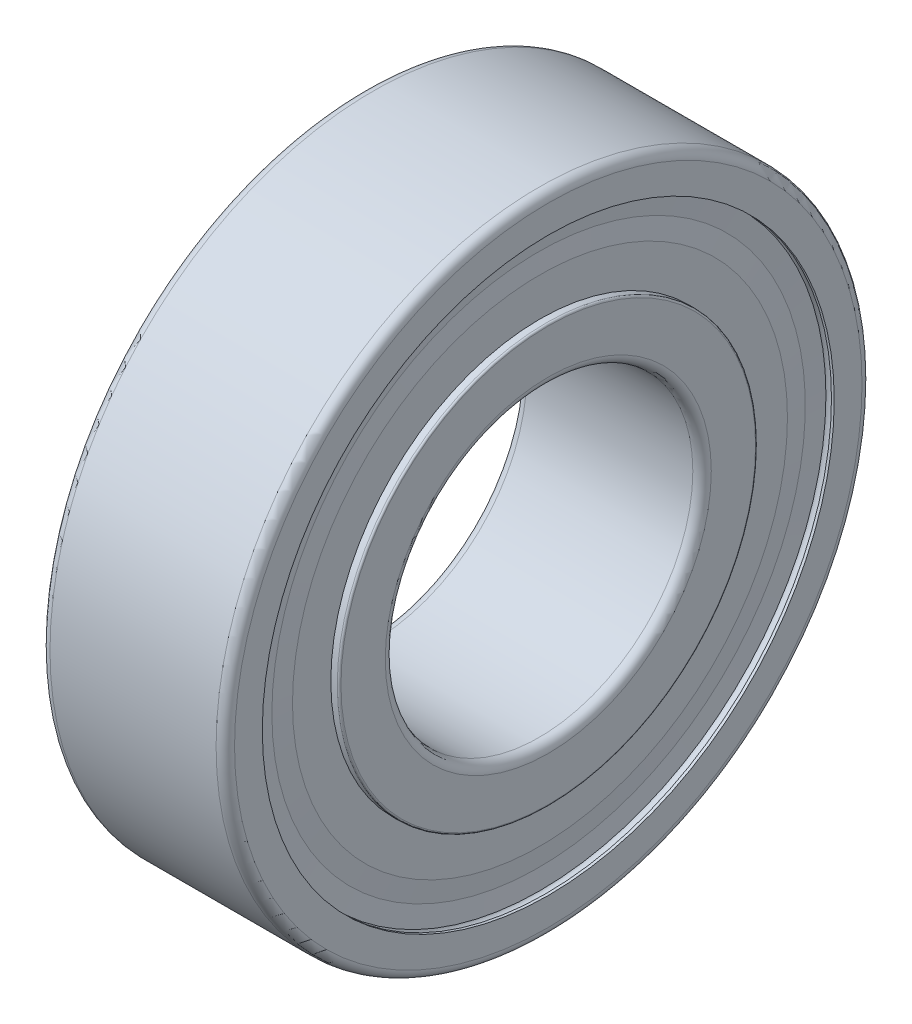
ISO-10303-21;
HEADER;
FILE_DESCRIPTION(('STEP AP214'),'2;1');
FILE_NAME('part.step','',(''),(''),'','','');
FILE_SCHEMA(('AUTOMOTIVE_DESIGN { 1 0 10303 214 1 1 1 1 }'));
ENDSEC;
DATA;
#1=APPLICATION_CONTEXT('core data for automotive mechanical design processes');
#2=APPLICATION_PROTOCOL_DEFINITION('international standard','automotive_design',2000,#1);
#3=PRODUCT_CONTEXT('',#1,'mechanical');
#4=PRODUCT('Part','Part','',(#3));
#5=PRODUCT_RELATED_PRODUCT_CATEGORY('part','',(#4));
#6=PRODUCT_DEFINITION_FORMATION('','',#4);
#7=PRODUCT_DEFINITION_CONTEXT('part definition',#1,'design');
#8=PRODUCT_DEFINITION('design','',#6,#7);
#9=PRODUCT_DEFINITION_SHAPE('','',#8);
#10=(LENGTH_UNIT() NAMED_UNIT(*) SI_UNIT(.MILLI.,.METRE.));
#11=(NAMED_UNIT(*) PLANE_ANGLE_UNIT() SI_UNIT($,.RADIAN.));
#12=(NAMED_UNIT(*) SI_UNIT($,.STERADIAN.) SOLID_ANGLE_UNIT());
#13=UNCERTAINTY_MEASURE_WITH_UNIT(LENGTH_MEASURE(1.E-05),#10,'distance_accuracy_value','');
#14=(GEOMETRIC_REPRESENTATION_CONTEXT(3) GLOBAL_UNCERTAINTY_ASSIGNED_CONTEXT((#13)) GLOBAL_UNIT_ASSIGNED_CONTEXT((#10,
#11,#12)) REPRESENTATION_CONTEXT('',''));
#15=CARTESIAN_POINT('',(0.,0.,0.));
#16=DIRECTION('',(0.,0.,1.));
#17=DIRECTION('',(1.,0.,0.));
#18=AXIS2_PLACEMENT_3D('',#15,#16,#17);
#19=CARTESIAN_POINT('',(50.,0.,0.));
#20=DIRECTION('',(1.,0.,0.));
#21=DIRECTION('',(0.,0.,1.));
#22=AXIS2_PLACEMENT_3D('',#19,#20,#21);
#23=CYLINDRICAL_SURFACE('',#22,18.595);
#24=CARTESIAN_POINT('',(11.46,0.,0.));
#25=DIRECTION('',(-1.,0.,0.));
#26=DIRECTION('',(0.,0.,1.));
#27=AXIS2_PLACEMENT_3D('',#24,#25,#26);
#28=CIRCLE('',#27,18.595);
#29=CARTESIAN_POINT('',(11.46,0.,18.595));
#30=VERTEX_POINT('',#29);
#31=EDGE_CURVE('E12',#30,#30,#28,.T.);
#32=ORIENTED_EDGE('',*,*,#31,.T.);
#33=EDGE_LOOP('',(#32));
#34=FACE_BOUND('',#33,.T.);
#35=CARTESIAN_POINT('',(11.28,0.,0.));
#36=DIRECTION('',(-1.,0.,0.));
#37=DIRECTION('',(0.,0.,1.));
#38=AXIS2_PLACEMENT_3D('',#35,#36,#37);
#39=CIRCLE('',#38,18.595);
#40=CARTESIAN_POINT('',(11.28,0.,18.595));
#41=VERTEX_POINT('',#40);
#42=EDGE_CURVE('E178',#41,#41,#39,.T.);
#43=ORIENTED_EDGE('',*,*,#42,.F.);
#44=EDGE_LOOP('',(#43));
#45=FACE_BOUND('',#44,.T.);
#46=ADVANCED_FACE('F52',(#34,#45),#23,.T.);
#47=CARTESIAN_POINT('',(11.37,0.,0.));
#48=DIRECTION('',(1.,0.,0.));
#49=DIRECTION('',(0.,0.,1.));
#50=AXIS2_PLACEMENT_3D('',#47,#48,#49);
#51=CONICAL_SURFACE('',#50,17.34375,1.49899191472693);
#52=CARTESIAN_POINT('',(11.37,0.,0.));
#53=DIRECTION('',(-1.,0.,0.));
#54=DIRECTION('',(0.,0.,1.));
#55=AXIS2_PLACEMENT_3D('',#52,#53,#54);
#56=CIRCLE('',#55,17.34375);
#57=CARTESIAN_POINT('',(11.37,0.,17.34375));
#58=VERTEX_POINT('',#57);
#59=EDGE_CURVE('E62',#58,#58,#56,.T.);
#60=ORIENTED_EDGE('',*,*,#59,.T.);
#61=EDGE_LOOP('',(#60));
#62=FACE_BOUND('',#61,.T.);
#63=ORIENTED_EDGE('',*,*,#31,.F.);
#64=EDGE_LOOP('',(#63));
#65=FACE_BOUND('',#64,.T.);
#66=ADVANCED_FACE('F216',(#62,#65),#51,.F.);
#67=CARTESIAN_POINT('',(11.46,0.,0.));
#68=DIRECTION('',(-1.,0.,0.));
#69=DIRECTION('',(0.,0.,-1.));
#70=AXIS2_PLACEMENT_3D('',#67,#68,#69);
#71=CONICAL_SURFACE('',#70,16.0925,1.49899191472693);
#72=CARTESIAN_POINT('',(11.46,0.,0.));
#73=DIRECTION('',(-1.,0.,0.));
#74=DIRECTION('',(0.,0.,1.));
#75=AXIS2_PLACEMENT_3D('',#72,#73,#74);
#76=CIRCLE('',#75,16.0925);
#77=CARTESIAN_POINT('',(11.46,0.,16.0925));
#78=VERTEX_POINT('',#77);
#79=EDGE_CURVE('E164',#78,#78,#76,.T.);
#80=ORIENTED_EDGE('',*,*,#79,.T.);
#81=EDGE_LOOP('',(#80));
#82=FACE_BOUND('',#81,.T.);
#83=ORIENTED_EDGE('',*,*,#59,.F.);
#84=EDGE_LOOP('',(#83));
#85=FACE_BOUND('',#84,.T.);
#86=ADVANCED_FACE('F54',(#82,#85),#71,.T.);
#87=CARTESIAN_POINT('',(11.46,13.59,0.));
#88=DIRECTION('',(1.,0.,0.));
#89=DIRECTION('',(0.,1.,0.));
#90=AXIS2_PLACEMENT_3D('',#87,#88,#89);
#91=PLANE('',#90);
#92=CARTESIAN_POINT('',(11.46,0.,0.));
#93=DIRECTION('',(1.,0.,0.));
#94=DIRECTION('',(0.,0.,1.));
#95=AXIS2_PLACEMENT_3D('',#92,#93,#94);
#96=CIRCLE('',#95,13.6);
#97=CARTESIAN_POINT('',(11.46,0.,13.6));
#98=VERTEX_POINT('',#97);
#99=EDGE_CURVE('E109',#98,#98,#96,.T.);
#100=ORIENTED_EDGE('',*,*,#99,.F.);
#101=EDGE_LOOP('',(#100));
#102=FACE_BOUND('',#101,.T.);
#103=ORIENTED_EDGE('',*,*,#79,.F.);
#104=EDGE_LOOP('',(#103));
#105=FACE_BOUND('',#104,.T.);
#106=ADVANCED_FACE('F244',(#102,#105),#91,.T.);
#107=CARTESIAN_POINT('',(11.1,0.,0.));
#108=DIRECTION('',(-1.,0.,0.));
#109=DIRECTION('',(0.,0.,-1.));
#110=AXIS2_PLACEMENT_3D('',#107,#108,#109);
#111=CONICAL_SURFACE('',#110,16.0925,1.49899191472693);
#112=CARTESIAN_POINT('',(11.1,0.,0.));
#113=DIRECTION('',(-1.,0.,0.));
#114=DIRECTION('',(0.,0.,1.));
#115=AXIS2_PLACEMENT_3D('',#112,#113,#114);
#116=CIRCLE('',#115,16.0925);
#117=CARTESIAN_POINT('',(11.1,0.,16.0925));
#118=VERTEX_POINT('',#117);
#119=EDGE_CURVE('E56',#118,#118,#116,.T.);
#120=ORIENTED_EDGE('',*,*,#119,.T.);
#121=EDGE_LOOP('',(#120));
#122=FACE_BOUND('',#121,.T.);
#123=CARTESIAN_POINT('',(11.2792807192807,0.,0.));
#124=DIRECTION('',(-1.,0.,0.));
#125=DIRECTION('',(0.,0.,-1.));
#126=AXIS2_PLACEMENT_3D('',#123,#124,#125);
#127=CIRCLE('',#126,13.6);
#128=CARTESIAN_POINT('',(11.2792807192807,0.,-13.6));
#129=VERTEX_POINT('',#128);
#130=EDGE_CURVE('E170',#129,#129,#127,.T.);
#131=ORIENTED_EDGE('',*,*,#130,.F.);
#132=EDGE_LOOP('',(#131));
#133=FACE_BOUND('',#132,.T.);
#134=ADVANCED_FACE('F211',(#122,#133),#111,.F.);
#135=CARTESIAN_POINT('',(11.1,17.34375,0.));
#136=DIRECTION('',(-1.,0.,0.));
#137=DIRECTION('',(0.,0.,-1.));
#138=AXIS2_PLACEMENT_3D('',#135,#136,#137);
#139=PLANE('',#138);
#140=CARTESIAN_POINT('',(11.1,0.,0.));
#141=DIRECTION('',(-1.,0.,0.));
#142=DIRECTION('',(0.,0.,1.));
#143=AXIS2_PLACEMENT_3D('',#140,#141,#142);
#144=CIRCLE('',#143,17.34375);
#145=CARTESIAN_POINT('',(11.1,0.,17.34375));
#146=VERTEX_POINT('',#145);
#147=EDGE_CURVE('E176',#146,#146,#144,.T.);
#148=ORIENTED_EDGE('',*,*,#147,.T.);
#149=EDGE_LOOP('',(#148));
#150=FACE_BOUND('',#149,.T.);
#151=ORIENTED_EDGE('',*,*,#119,.F.);
#152=EDGE_LOOP('',(#151));
#153=FACE_BOUND('',#152,.T.);
#154=ADVANCED_FACE('F196',(#150,#153),#139,.T.);
#155=CARTESIAN_POINT('',(11.28,0.,0.));
#156=DIRECTION('',(1.,0.,0.));
#157=DIRECTION('',(0.,0.,1.));
#158=AXIS2_PLACEMENT_3D('',#155,#156,#157);
#159=CONICAL_SURFACE('',#158,18.595,1.42792038843124);
#160=ORIENTED_EDGE('',*,*,#42,.T.);
#161=EDGE_LOOP('',(#160));
#162=FACE_BOUND('',#161,.T.);
#163=ORIENTED_EDGE('',*,*,#147,.F.);
#164=EDGE_LOOP('',(#163));
#165=FACE_BOUND('',#164,.T.);
#166=ADVANCED_FACE('F199',(#162,#165),#159,.T.);
#167=CARTESIAN_POINT('',(0.9,0.,0.));
#168=DIRECTION('',(-1.,0.,0.));
#169=DIRECTION('',(0.,0.,-1.));
#170=AXIS2_PLACEMENT_3D('',#167,#168,#169);
#171=CONICAL_SURFACE('',#170,17.34375,1.42792038843124);
#172=CARTESIAN_POINT('',(0.9,0.,0.));
#173=DIRECTION('',(-1.,0.,0.));
#174=DIRECTION('',(0.,0.,1.));
#175=AXIS2_PLACEMENT_3D('',#172,#173,#174);
#176=CIRCLE('',#175,17.34375);
#177=CARTESIAN_POINT('',(0.9,0.,17.34375));
#178=VERTEX_POINT('',#177);
#179=EDGE_CURVE('E174',#178,#178,#176,.T.);
#180=ORIENTED_EDGE('',*,*,#179,.T.);
#181=EDGE_LOOP('',(#180));
#182=FACE_BOUND('',#181,.T.);
#183=CARTESIAN_POINT('',(0.72,0.,0.));
#184=DIRECTION('',(-1.,0.,0.));
#185=DIRECTION('',(0.,0.,1.));
#186=AXIS2_PLACEMENT_3D('',#183,#184,#185);
#187=CIRCLE('',#186,18.595);
#188=CARTESIAN_POINT('',(0.72,0.,18.595));
#189=VERTEX_POINT('',#188);
#190=EDGE_CURVE('E182',#189,#189,#187,.T.);
#191=ORIENTED_EDGE('',*,*,#190,.F.);
#192=EDGE_LOOP('',(#191));
#193=FACE_BOUND('',#192,.T.);
#194=ADVANCED_FACE('F201',(#182,#193),#171,.T.);
#195=CARTESIAN_POINT('',(0.9,16.0925,0.));
#196=DIRECTION('',(1.,0.,0.));
#197=DIRECTION('',(0.,1.,0.));
#198=AXIS2_PLACEMENT_3D('',#195,#196,#197);
#199=PLANE('',#198);
#200=CARTESIAN_POINT('',(0.9,0.,0.));
#201=DIRECTION('',(-1.,0.,0.));
#202=DIRECTION('',(0.,0.,1.));
#203=AXIS2_PLACEMENT_3D('',#200,#201,#202);
#204=CIRCLE('',#203,16.0925);
#205=CARTESIAN_POINT('',(0.9,0.,16.0925));
#206=VERTEX_POINT('',#205);
#207=EDGE_CURVE('E177',#206,#206,#204,.T.);
#208=ORIENTED_EDGE('',*,*,#207,.T.);
#209=EDGE_LOOP('',(#208));
#210=FACE_BOUND('',#209,.T.);
#211=ORIENTED_EDGE('',*,*,#179,.F.);
#212=EDGE_LOOP('',(#211));
#213=FACE_BOUND('',#212,.T.);
#214=ADVANCED_FACE('F208',(#210,#213),#199,.T.);
#215=CARTESIAN_POINT('',(0.72,0.,0.));
#216=DIRECTION('',(1.,0.,0.));
#217=DIRECTION('',(0.,0.,1.));
#218=AXIS2_PLACEMENT_3D('',#215,#216,#217);
#219=CONICAL_SURFACE('',#218,13.59,1.49899191472693);
#220=CARTESIAN_POINT('',(0.720719280719279,0.,0.));
#221=DIRECTION('',(1.,0.,0.));
#222=DIRECTION('',(0.,0.,1.));
#223=AXIS2_PLACEMENT_3D('',#220,#221,#222);
#224=CIRCLE('',#223,13.6);
#225=CARTESIAN_POINT('',(0.720719280719279,0.,13.6));
#226=VERTEX_POINT('',#225);
#227=EDGE_CURVE('E187',#226,#226,#224,.T.);
#228=ORIENTED_EDGE('',*,*,#227,.F.);
#229=EDGE_LOOP('',(#228));
#230=FACE_BOUND('',#229,.T.);
#231=ORIENTED_EDGE('',*,*,#207,.F.);
#232=EDGE_LOOP('',(#231));
#233=FACE_BOUND('',#232,.T.);
#234=ADVANCED_FACE('F226',(#230,#233),#219,.F.);
#235=CARTESIAN_POINT('',(0.54,16.0925,0.));
#236=DIRECTION('',(-1.,0.,0.));
#237=DIRECTION('',(0.,0.,-1.));
#238=AXIS2_PLACEMENT_3D('',#235,#236,#237);
#239=PLANE('',#238);
#240=CARTESIAN_POINT('',(0.54,0.,0.));
#241=DIRECTION('',(-1.,0.,0.));
#242=DIRECTION('',(0.,0.,1.));
#243=AXIS2_PLACEMENT_3D('',#240,#241,#242);
#244=CIRCLE('',#243,16.0925);
#245=CARTESIAN_POINT('',(0.54,0.,16.0925));
#246=VERTEX_POINT('',#245);
#247=EDGE_CURVE('E180',#246,#246,#244,.T.);
#248=ORIENTED_EDGE('',*,*,#247,.T.);
#249=EDGE_LOOP('',(#248));
#250=FACE_BOUND('',#249,.T.);
#251=CARTESIAN_POINT('',(0.54,0.,0.));
#252=DIRECTION('',(-1.,0.,0.));
#253=DIRECTION('',(0.,0.,-1.));
#254=AXIS2_PLACEMENT_3D('',#251,#252,#253);
#255=CIRCLE('',#254,13.6);
#256=CARTESIAN_POINT('',(0.54,0.,-13.6));
#257=VERTEX_POINT('',#256);
#258=EDGE_CURVE('E166',#257,#257,#255,.T.);
#259=ORIENTED_EDGE('',*,*,#258,.F.);
#260=EDGE_LOOP('',(#259));
#261=FACE_BOUND('',#260,.T.);
#262=ADVANCED_FACE('F229',(#250,#261),#239,.T.);
#263=CARTESIAN_POINT('',(0.63,0.,0.));
#264=DIRECTION('',(1.,0.,0.));
#265=DIRECTION('',(0.,0.,1.));
#266=AXIS2_PLACEMENT_3D('',#263,#264,#265);
#267=CONICAL_SURFACE('',#266,17.34375,1.49899191472693);
#268=CARTESIAN_POINT('',(0.63,0.,0.));
#269=DIRECTION('',(-1.,0.,0.));
#270=DIRECTION('',(0.,0.,1.));
#271=AXIS2_PLACEMENT_3D('',#268,#269,#270);
#272=CIRCLE('',#271,17.34375);
#273=CARTESIAN_POINT('',(0.63,0.,17.34375));
#274=VERTEX_POINT('',#273);
#275=EDGE_CURVE('E181',#274,#274,#272,.T.);
#276=ORIENTED_EDGE('',*,*,#275,.T.);
#277=EDGE_LOOP('',(#276));
#278=FACE_BOUND('',#277,.T.);
#279=ORIENTED_EDGE('',*,*,#247,.F.);
#280=EDGE_LOOP('',(#279));
#281=FACE_BOUND('',#280,.T.);
#282=ADVANCED_FACE('F251',(#278,#281),#267,.T.);
#283=CARTESIAN_POINT('',(0.54,0.,0.));
#284=DIRECTION('',(-1.,0.,0.));
#285=DIRECTION('',(0.,0.,-1.));
#286=AXIS2_PLACEMENT_3D('',#283,#284,#285);
#287=CONICAL_SURFACE('',#286,18.595,1.49899191472693);
#288=CARTESIAN_POINT('',(0.54,0.,0.));
#289=DIRECTION('',(-1.,0.,0.));
#290=DIRECTION('',(0.,0.,1.));
#291=AXIS2_PLACEMENT_3D('',#288,#289,#290);
#292=CIRCLE('',#291,18.595);
#293=CARTESIAN_POINT('',(0.54,0.,18.595));
#294=VERTEX_POINT('',#293);
#295=EDGE_CURVE('E183',#294,#294,#292,.T.);
#296=ORIENTED_EDGE('',*,*,#295,.T.);
#297=EDGE_LOOP('',(#296));
#298=FACE_BOUND('',#297,.T.);
#299=ORIENTED_EDGE('',*,*,#275,.F.);
#300=EDGE_LOOP('',(#299));
#301=FACE_BOUND('',#300,.T.);
#302=ADVANCED_FACE('F254',(#298,#301),#287,.F.);
#303=CARTESIAN_POINT('',(50.,0.,0.));
#304=DIRECTION('',(1.,0.,0.));
#305=DIRECTION('',(0.,0.,1.));
#306=AXIS2_PLACEMENT_3D('',#303,#304,#305);
#307=CYLINDRICAL_SURFACE('',#306,18.595);
#308=ORIENTED_EDGE('',*,*,#190,.T.);
#309=EDGE_LOOP('',(#308));
#310=FACE_BOUND('',#309,.T.);
#311=ORIENTED_EDGE('',*,*,#295,.F.);
#312=EDGE_LOOP('',(#311));
#313=FACE_BOUND('',#312,.T.);
#314=ADVANCED_FACE('F292',(#310,#313),#307,.T.);
#315=CARTESIAN_POINT('',(50.,0.,0.));
#316=DIRECTION('',(1.,0.,0.));
#317=DIRECTION('',(0.,0.,1.));
#318=AXIS2_PLACEMENT_3D('',#315,#316,#317);
#319=CYLINDRICAL_SURFACE('',#318,13.6);
#320=CARTESIAN_POINT('',(3.45625767814427,0.,0.));
#321=DIRECTION('',(-1.,0.,0.));
#322=DIRECTION('',(0.,0.,1.));
#323=AXIS2_PLACEMENT_3D('',#320,#321,#322);
#324=CIRCLE('',#323,13.6);
#325=CARTESIAN_POINT('',(3.45625767814427,0.,13.6));
#326=VERTEX_POINT('',#325);
#327=EDGE_CURVE('E191',#326,#326,#324,.T.);
#328=ORIENTED_EDGE('',*,*,#327,.T.);
#329=EDGE_LOOP('',(#328));
#330=FACE_BOUND('',#329,.T.);
#331=ORIENTED_EDGE('',*,*,#227,.T.);
#332=EDGE_LOOP('',(#331));
#333=FACE_BOUND('',#332,.T.);
#334=ADVANCED_FACE('F280',(#330,#333),#319,.T.);
#335=CARTESIAN_POINT('',(6.,0.,0.));
#336=DIRECTION('',(1.,0.,0.));
#337=DIRECTION('',(0.,0.,1.));
#338=AXIS2_PLACEMENT_3D('',#335,#336,#337);
#339=TOROIDAL_SURFACE('',#338,15.5,3.175);
#340=ORIENTED_EDGE('',*,*,#327,.F.);
#341=EDGE_LOOP('',(#340));
#342=FACE_BOUND('',#341,.T.);
#343=CARTESIAN_POINT('',(8.54374232185574,0.,0.));
#344=DIRECTION('',(-1.,0.,0.));
#345=DIRECTION('',(0.,0.,1.));
#346=AXIS2_PLACEMENT_3D('',#343,#344,#345);
#347=CIRCLE('',#346,13.6);
#348=CARTESIAN_POINT('',(8.54374232185574,0.,13.6));
#349=VERTEX_POINT('',#348);
#350=EDGE_CURVE('E173',#349,#349,#347,.T.);
#351=ORIENTED_EDGE('',*,*,#350,.T.);
#352=EDGE_LOOP('',(#351));
#353=FACE_BOUND('',#352,.T.);
#354=ADVANCED_FACE('F283',(#342,#353),#339,.F.);
#355=CARTESIAN_POINT('',(50.,0.,0.));
#356=DIRECTION('',(1.,0.,0.));
#357=DIRECTION('',(0.,0.,1.));
#358=AXIS2_PLACEMENT_3D('',#355,#356,#357);
#359=CYLINDRICAL_SURFACE('',#358,13.6);
#360=CARTESIAN_POINT('',(11.88,0.,0.));
#361=DIRECTION('',(-1.,0.,0.));
#362=DIRECTION('',(0.,0.,1.));
#363=AXIS2_PLACEMENT_3D('',#360,#361,#362);
#364=CIRCLE('',#363,13.6);
#365=CARTESIAN_POINT('',(11.88,0.,13.6));
#366=VERTEX_POINT('',#365);
#367=EDGE_CURVE('E117',#366,#366,#364,.T.);
#368=ORIENTED_EDGE('',*,*,#367,.T.);
#369=EDGE_LOOP('',(#368));
#370=FACE_BOUND('',#369,.T.);
#371=ORIENTED_EDGE('',*,*,#99,.T.);
#372=EDGE_LOOP('',(#371));
#373=FACE_BOUND('',#372,.T.);
#374=ADVANCED_FACE('F285',(#370,#373),#359,.T.);
#375=CARTESIAN_POINT('',(11.88,0.,0.));
#376=DIRECTION('',(1.,0.,0.));
#377=DIRECTION('',(0.,0.,1.));
#378=AXIS2_PLACEMENT_3D('',#375,#376,#377);
#379=TOROIDAL_SURFACE('',#378,13.48,0.12);
#380=CARTESIAN_POINT('',(12.,0.,0.));
#381=DIRECTION('',(-1.,0.,0.));
#382=DIRECTION('',(0.,0.,1.));
#383=AXIS2_PLACEMENT_3D('',#380,#381,#382);
#384=CIRCLE('',#383,13.48);
#385=CARTESIAN_POINT('',(12.,0.,13.48));
#386=VERTEX_POINT('',#385);
#387=EDGE_CURVE('E151',#386,#386,#384,.T.);
#388=ORIENTED_EDGE('',*,*,#387,.T.);
#389=EDGE_LOOP('',(#388));
#390=FACE_BOUND('',#389,.T.);
#391=ORIENTED_EDGE('',*,*,#367,.F.);
#392=EDGE_LOOP('',(#391));
#393=FACE_BOUND('',#392,.T.);
#394=ADVANCED_FACE('F249',(#390,#393),#379,.T.);
#395=CARTESIAN_POINT('',(12.,10.6,0.));
#396=DIRECTION('',(1.,0.,0.));
#397=DIRECTION('',(0.,1.,0.));
#398=AXIS2_PLACEMENT_3D('',#395,#396,#397);
#399=PLANE('',#398);
#400=CARTESIAN_POINT('',(12.,0.,0.));
#401=DIRECTION('',(-1.,0.,0.));
#402=DIRECTION('',(0.,0.,1.));
#403=AXIS2_PLACEMENT_3D('',#400,#401,#402);
#404=CIRCLE('',#403,10.6);
#405=CARTESIAN_POINT('',(12.,0.,10.6));
#406=VERTEX_POINT('',#405);
#407=EDGE_CURVE('E148',#406,#406,#404,.T.);
#408=ORIENTED_EDGE('',*,*,#407,.T.);
#409=EDGE_LOOP('',(#408));
#410=FACE_BOUND('',#409,.T.);
#411=ORIENTED_EDGE('',*,*,#387,.F.);
#412=EDGE_LOOP('',(#411));
#413=FACE_BOUND('',#412,.T.);
#414=ADVANCED_FACE('F246',(#410,#413),#399,.T.);
#415=CARTESIAN_POINT('',(11.4,0.,0.));
#416=DIRECTION('',(1.,0.,0.));
#417=DIRECTION('',(0.,0.,1.));
#418=AXIS2_PLACEMENT_3D('',#415,#416,#417);
#419=TOROIDAL_SURFACE('',#418,10.6,0.6);
#420=CARTESIAN_POINT('',(11.4,0.,0.));
#421=DIRECTION('',(-1.,0.,0.));
#422=DIRECTION('',(0.,0.,1.));
#423=AXIS2_PLACEMENT_3D('',#420,#421,#422);
#424=CIRCLE('',#423,10.);
#425=CARTESIAN_POINT('',(11.4,0.,10.));
#426=VERTEX_POINT('',#425);
#427=EDGE_CURVE('E144',#426,#426,#424,.T.);
#428=ORIENTED_EDGE('',*,*,#427,.T.);
#429=EDGE_LOOP('',(#428));
#430=FACE_BOUND('',#429,.T.);
#431=ORIENTED_EDGE('',*,*,#407,.F.);
#432=EDGE_LOOP('',(#431));
#433=FACE_BOUND('',#432,.T.);
#434=ADVANCED_FACE('F145',(#430,#433),#419,.T.);
#435=CARTESIAN_POINT('',(50.,0.,0.));
#436=DIRECTION('',(1.,0.,0.));
#437=DIRECTION('',(0.,0.,1.));
#438=AXIS2_PLACEMENT_3D('',#435,#436,#437);
#439=CYLINDRICAL_SURFACE('',#438,10.);
#440=CARTESIAN_POINT('',(0.6,0.,0.));
#441=DIRECTION('',(-1.,0.,0.));
#442=DIRECTION('',(0.,0.,1.));
#443=AXIS2_PLACEMENT_3D('',#440,#441,#442);
#444=CIRCLE('',#443,10.);
#445=CARTESIAN_POINT('',(0.6,0.,10.));
#446=VERTEX_POINT('',#445);
#447=EDGE_CURVE('E149',#446,#446,#444,.T.);
#448=ORIENTED_EDGE('',*,*,#447,.T.);
#449=EDGE_LOOP('',(#448));
#450=FACE_BOUND('',#449,.T.);
#451=ORIENTED_EDGE('',*,*,#427,.F.);
#452=EDGE_LOOP('',(#451));
#453=FACE_BOUND('',#452,.T.);
#454=ADVANCED_FACE('F235',(#450,#453),#439,.F.);
#455=CARTESIAN_POINT('',(0.6,0.,0.));
#456=DIRECTION('',(1.,0.,0.));
#457=DIRECTION('',(0.,0.,1.));
#458=AXIS2_PLACEMENT_3D('',#455,#456,#457);
#459=TOROIDAL_SURFACE('',#458,10.6,0.6);
#460=CARTESIAN_POINT('',(0.,0.,0.));
#461=DIRECTION('',(-1.,0.,0.));
#462=DIRECTION('',(0.,0.,1.));
#463=AXIS2_PLACEMENT_3D('',#460,#461,#462);
#464=CIRCLE('',#463,10.6);
#465=CARTESIAN_POINT('',(0.,0.,10.6));
#466=VERTEX_POINT('',#465);
#467=EDGE_CURVE('E153',#466,#466,#464,.T.);
#468=ORIENTED_EDGE('',*,*,#467,.T.);
#469=EDGE_LOOP('',(#468));
#470=FACE_BOUND('',#469,.T.);
#471=ORIENTED_EDGE('',*,*,#447,.F.);
#472=EDGE_LOOP('',(#471));
#473=FACE_BOUND('',#472,.T.);
#474=ADVANCED_FACE('F231',(#470,#473),#459,.T.);
#475=CARTESIAN_POINT('',(0.,13.48,0.));
#476=DIRECTION('',(-1.,0.,0.));
#477=DIRECTION('',(0.,0.,-1.));
#478=AXIS2_PLACEMENT_3D('',#475,#476,#477);
#479=PLANE('',#478);
#480=CARTESIAN_POINT('',(0.,0.,0.));
#481=DIRECTION('',(-1.,0.,0.));
#482=DIRECTION('',(0.,0.,1.));
#483=AXIS2_PLACEMENT_3D('',#480,#481,#482);
#484=CIRCLE('',#483,13.48);
#485=CARTESIAN_POINT('',(0.,0.,13.48));
#486=VERTEX_POINT('',#485);
#487=EDGE_CURVE('E160',#486,#486,#484,.T.);
#488=ORIENTED_EDGE('',*,*,#487,.T.);
#489=EDGE_LOOP('',(#488));
#490=FACE_BOUND('',#489,.T.);
#491=ORIENTED_EDGE('',*,*,#467,.F.);
#492=EDGE_LOOP('',(#491));
#493=FACE_BOUND('',#492,.T.);
#494=ADVANCED_FACE('F234',(#490,#493),#479,.T.);
#495=CARTESIAN_POINT('',(0.12,0.,0.));
#496=DIRECTION('',(1.,0.,0.));
#497=DIRECTION('',(0.,0.,1.));
#498=AXIS2_PLACEMENT_3D('',#495,#496,#497);
#499=TOROIDAL_SURFACE('',#498,13.48,0.12);
#500=CARTESIAN_POINT('',(0.120000000000002,0.,0.));
#501=DIRECTION('',(-1.,0.,0.));
#502=DIRECTION('',(0.,0.,1.));
#503=AXIS2_PLACEMENT_3D('',#500,#501,#502);
#504=CIRCLE('',#503,13.6);
#505=CARTESIAN_POINT('',(0.120000000000002,0.,13.6));
#506=VERTEX_POINT('',#505);
#507=EDGE_CURVE('E168',#506,#506,#504,.T.);
#508=ORIENTED_EDGE('',*,*,#507,.T.);
#509=EDGE_LOOP('',(#508));
#510=FACE_BOUND('',#509,.T.);
#511=ORIENTED_EDGE('',*,*,#487,.F.);
#512=EDGE_LOOP('',(#511));
#513=FACE_BOUND('',#512,.T.);
#514=ADVANCED_FACE('F237',(#510,#513),#499,.T.);
#515=CARTESIAN_POINT('',(50.,0.,0.));
#516=DIRECTION('',(1.,0.,0.));
#517=DIRECTION('',(0.,0.,1.));
#518=AXIS2_PLACEMENT_3D('',#515,#516,#517);
#519=CYLINDRICAL_SURFACE('',#518,13.6);
#520=ORIENTED_EDGE('',*,*,#258,.T.);
#521=EDGE_LOOP('',(#520));
#522=FACE_BOUND('',#521,.T.);
#523=ORIENTED_EDGE('',*,*,#507,.F.);
#524=EDGE_LOOP('',(#523));
#525=FACE_BOUND('',#524,.T.);
#526=ADVANCED_FACE('F240',(#522,#525),#519,.T.);
#527=CARTESIAN_POINT('',(50.,0.,0.));
#528=DIRECTION('',(1.,0.,0.));
#529=DIRECTION('',(0.,0.,1.));
#530=AXIS2_PLACEMENT_3D('',#527,#528,#529);
#531=CYLINDRICAL_SURFACE('',#530,13.6);
#532=ORIENTED_EDGE('',*,*,#130,.T.);
#533=EDGE_LOOP('',(#532));
#534=FACE_BOUND('',#533,.T.);
#535=ORIENTED_EDGE('',*,*,#350,.F.);
#536=EDGE_LOOP('',(#535));
#537=FACE_BOUND('',#536,.T.);
#538=ADVANCED_FACE('F256',(#534,#537),#531,.T.);
#539=CLOSED_SHELL('',(#46,#66,#86,#106,#134,#154,#166,#194,#214,#234,#262,#282,#302,#314,#334,
#354,#374,#394,#414,#434,#454,#474,#494,#514,#526,#538));
#540=MANIFOLD_SOLID_BREP('B2',#539);
#541=CARTESIAN_POINT('',(50.,0.,0.));
#542=DIRECTION('',(1.,0.,0.));
#543=DIRECTION('',(0.,0.,1.));
#544=AXIS2_PLACEMENT_3D('',#541,#542,#543);
#545=CYLINDRICAL_SURFACE('',#544,21.);
#546=CARTESIAN_POINT('',(11.4,0.,0.));
#547=DIRECTION('',(-1.,0.,0.));
#548=DIRECTION('',(0.,0.,1.));
#549=AXIS2_PLACEMENT_3D('',#546,#547,#548);
#550=CIRCLE('',#549,21.);
#551=CARTESIAN_POINT('',(11.4,0.,21.));
#552=VERTEX_POINT('',#551);
#553=EDGE_CURVE('E50',#552,#552,#550,.T.);
#554=ORIENTED_EDGE('',*,*,#553,.T.);
#555=EDGE_LOOP('',(#554));
#556=FACE_BOUND('',#555,.T.);
#557=CARTESIAN_POINT('',(0.6,0.,0.));
#558=DIRECTION('',(-1.,0.,0.));
#559=DIRECTION('',(0.,0.,1.));
#560=AXIS2_PLACEMENT_3D('',#557,#558,#559);
#561=CIRCLE('',#560,21.);
#562=CARTESIAN_POINT('',(0.6,0.,21.));
#563=VERTEX_POINT('',#562);
#564=EDGE_CURVE('E573',#563,#563,#561,.T.);
#565=ORIENTED_EDGE('',*,*,#564,.F.);
#566=EDGE_LOOP('',(#565));
#567=FACE_BOUND('',#566,.T.);
#568=ADVANCED_FACE('F502',(#556,#567),#545,.T.);
#569=CARTESIAN_POINT('',(11.4,0.,0.));
#570=DIRECTION('',(1.,0.,0.));
#571=DIRECTION('',(0.,0.,1.));
#572=AXIS2_PLACEMENT_3D('',#569,#570,#571);
#573=TOROIDAL_SURFACE('',#572,20.4,0.600000000000007);
#574=CARTESIAN_POINT('',(12.,0.,0.));
#575=DIRECTION('',(-1.,0.,0.));
#576=DIRECTION('',(0.,0.,1.));
#577=AXIS2_PLACEMENT_3D('',#574,#575,#576);
#578=CIRCLE('',#577,20.4);
#579=CARTESIAN_POINT('',(12.,0.,20.4));
#580=VERTEX_POINT('',#579);
#581=EDGE_CURVE('E512',#580,#580,#578,.T.);
#582=ORIENTED_EDGE('',*,*,#581,.T.);
#583=EDGE_LOOP('',(#582));
#584=FACE_BOUND('',#583,.T.);
#585=ORIENTED_EDGE('',*,*,#553,.F.);
#586=EDGE_LOOP('',(#585));
#587=FACE_BOUND('',#586,.T.);
#588=ADVANCED_FACE('F600',(#584,#587),#573,.T.);
#589=CARTESIAN_POINT('',(12.,18.595,0.));
#590=DIRECTION('',(1.,0.,0.));
#591=DIRECTION('',(0.,1.,0.));
#592=AXIS2_PLACEMENT_3D('',#589,#590,#591);
#593=PLANE('',#592);
#594=CARTESIAN_POINT('',(12.,0.,0.));
#595=DIRECTION('',(-1.,0.,0.));
#596=DIRECTION('',(0.,0.,1.));
#597=AXIS2_PLACEMENT_3D('',#594,#595,#596);
#598=CIRCLE('',#597,18.595);
#599=CARTESIAN_POINT('',(12.,0.,18.595));
#600=VERTEX_POINT('',#599);
#601=EDGE_CURVE('E569',#600,#600,#598,.T.);
#602=ORIENTED_EDGE('',*,*,#601,.T.);
#603=EDGE_LOOP('',(#602));
#604=FACE_BOUND('',#603,.T.);
#605=ORIENTED_EDGE('',*,*,#581,.F.);
#606=EDGE_LOOP('',(#605));
#607=FACE_BOUND('',#606,.T.);
#608=ADVANCED_FACE('F605',(#604,#607),#593,.T.);
#609=CARTESIAN_POINT('',(50.,0.,0.));
#610=DIRECTION('',(1.,0.,0.));
#611=DIRECTION('',(0.,0.,1.));
#612=AXIS2_PLACEMENT_3D('',#609,#610,#611);
#613=CYLINDRICAL_SURFACE('',#612,18.595);
#614=CARTESIAN_POINT('',(11.82,0.,0.));
#615=DIRECTION('',(-1.,0.,0.));
#616=DIRECTION('',(0.,0.,1.));
#617=AXIS2_PLACEMENT_3D('',#614,#615,#616);
#618=CIRCLE('',#617,18.595);
#619=CARTESIAN_POINT('',(11.82,0.,18.595));
#620=VERTEX_POINT('',#619);
#621=EDGE_CURVE('E567',#620,#620,#618,.T.);
#622=ORIENTED_EDGE('',*,*,#621,.T.);
#623=EDGE_LOOP('',(#622));
#624=FACE_BOUND('',#623,.T.);
#625=ORIENTED_EDGE('',*,*,#601,.F.);
#626=EDGE_LOOP('',(#625));
#627=FACE_BOUND('',#626,.T.);
#628=ADVANCED_FACE('F595',(#624,#627),#613,.F.);
#629=CARTESIAN_POINT('',(11.46,0.,0.));
#630=DIRECTION('',(1.,0.,0.));
#631=DIRECTION('',(0.,0.,1.));
#632=AXIS2_PLACEMENT_3D('',#629,#630,#631);
#633=TOROIDAL_SURFACE('',#632,18.5950000189953,0.36);
#634=ORIENTED_EDGE('',*,*,#621,.F.);
#635=EDGE_LOOP('',(#634));
#636=FACE_BOUND('',#635,.T.);
#637=CARTESIAN_POINT('',(11.1,0.,0.));
#638=DIRECTION('',(-1.,0.,0.));
#639=DIRECTION('',(0.,0.,1.));
#640=AXIS2_PLACEMENT_3D('',#637,#638,#639);
#641=CIRCLE('',#640,18.595);
#642=CARTESIAN_POINT('',(11.1,0.,18.595));
#643=VERTEX_POINT('',#642);
#644=EDGE_CURVE('E570',#643,#643,#641,.T.);
#645=ORIENTED_EDGE('',*,*,#644,.T.);
#646=EDGE_LOOP('',(#645));
#647=FACE_BOUND('',#646,.T.);
#648=ADVANCED_FACE('F504',(#636,#647),#633,.F.);
#649=CARTESIAN_POINT('',(10.8892892580534,0.,0.));
#650=DIRECTION('',(1.,0.,0.));
#651=DIRECTION('',(0.,0.,1.));
#652=AXIS2_PLACEMENT_3D('',#649,#650,#651);
#653=CONICAL_SURFACE('',#652,17.4,1.39626340159546);
#654=CARTESIAN_POINT('',(10.8892892580534,0.,0.));
#655=DIRECTION('',(-1.,0.,0.));
#656=DIRECTION('',(0.,0.,1.));
#657=AXIS2_PLACEMENT_3D('',#654,#655,#656);
#658=CIRCLE('',#657,17.4);
#659=CARTESIAN_POINT('',(10.8892892580534,0.,17.4));
#660=VERTEX_POINT('',#659);
#661=EDGE_CURVE('E558',#660,#660,#658,.T.);
#662=ORIENTED_EDGE('',*,*,#661,.T.);
#663=EDGE_LOOP('',(#662));
#664=FACE_BOUND('',#663,.T.);
#665=ORIENTED_EDGE('',*,*,#644,.F.);
#666=EDGE_LOOP('',(#665));
#667=FACE_BOUND('',#666,.T.);
#668=ADVANCED_FACE('F584',(#664,#667),#653,.F.);
#669=CARTESIAN_POINT('',(50.,0.,0.));
#670=DIRECTION('',(1.,0.,0.));
#671=DIRECTION('',(0.,0.,1.));
#672=AXIS2_PLACEMENT_3D('',#669,#670,#671);
#673=CYLINDRICAL_SURFACE('',#672,17.4);
#674=CARTESIAN_POINT('',(8.54374232185574,0.,0.));
#675=DIRECTION('',(-1.,0.,0.));
#676=DIRECTION('',(0.,0.,1.));
#677=AXIS2_PLACEMENT_3D('',#674,#675,#676);
#678=CIRCLE('',#677,17.4);
#679=CARTESIAN_POINT('',(8.54374232185574,0.,17.4));
#680=VERTEX_POINT('',#679);
#681=EDGE_CURVE('E556',#680,#680,#678,.T.);
#682=ORIENTED_EDGE('',*,*,#681,.T.);
#683=EDGE_LOOP('',(#682));
#684=FACE_BOUND('',#683,.T.);
#685=ORIENTED_EDGE('',*,*,#661,.F.);
#686=EDGE_LOOP('',(#685));
#687=FACE_BOUND('',#686,.T.);
#688=ADVANCED_FACE('F586',(#684,#687),#673,.F.);
#689=CARTESIAN_POINT('',(6.,0.,0.));
#690=DIRECTION('',(1.,0.,0.));
#691=DIRECTION('',(0.,0.,1.));
#692=AXIS2_PLACEMENT_3D('',#689,#690,#691);
#693=TOROIDAL_SURFACE('',#692,15.5,3.175);
#694=ORIENTED_EDGE('',*,*,#681,.F.);
#695=EDGE_LOOP('',(#694));
#696=FACE_BOUND('',#695,.T.);
#697=CARTESIAN_POINT('',(3.45625767814427,0.,0.));
#698=DIRECTION('',(-1.,0.,0.));
#699=DIRECTION('',(0.,0.,1.));
#700=AXIS2_PLACEMENT_3D('',#697,#698,#699);
#701=CIRCLE('',#700,17.4);
#702=CARTESIAN_POINT('',(3.45625767814427,0.,17.4));
#703=VERTEX_POINT('',#702);
#704=EDGE_CURVE('E506',#703,#703,#701,.T.);
#705=ORIENTED_EDGE('',*,*,#704,.T.);
#706=EDGE_LOOP('',(#705));
#707=FACE_BOUND('',#706,.T.);
#708=ADVANCED_FACE('F554',(#696,#707),#693,.F.);
#709=CARTESIAN_POINT('',(50.,0.,0.));
#710=DIRECTION('',(1.,0.,0.));
#711=DIRECTION('',(0.,0.,1.));
#712=AXIS2_PLACEMENT_3D('',#709,#710,#711);
#713=CYLINDRICAL_SURFACE('',#712,17.4);
#714=CARTESIAN_POINT('',(1.11071074194662,0.,0.));
#715=DIRECTION('',(-1.,0.,0.));
#716=DIRECTION('',(0.,0.,1.));
#717=AXIS2_PLACEMENT_3D('',#714,#715,#716);
#718=CIRCLE('',#717,17.4);
#719=CARTESIAN_POINT('',(1.11071074194662,0.,17.4));
#720=VERTEX_POINT('',#719);
#721=EDGE_CURVE('E557',#720,#720,#718,.T.);
#722=ORIENTED_EDGE('',*,*,#721,.T.);
#723=EDGE_LOOP('',(#722));
#724=FACE_BOUND('',#723,.T.);
#725=ORIENTED_EDGE('',*,*,#704,.F.);
#726=EDGE_LOOP('',(#725));
#727=FACE_BOUND('',#726,.T.);
#728=ADVANCED_FACE('F627',(#724,#727),#713,.F.);
#729=CARTESIAN_POINT('',(0.9,0.,0.));
#730=DIRECTION('',(-1.,0.,0.));
#731=DIRECTION('',(0.,0.,-1.));
#732=AXIS2_PLACEMENT_3D('',#729,#730,#731);
#733=CONICAL_SURFACE('',#732,18.595,1.39626340159547);
#734=CARTESIAN_POINT('',(0.9,0.,0.));
#735=DIRECTION('',(-1.,0.,0.));
#736=DIRECTION('',(0.,0.,1.));
#737=AXIS2_PLACEMENT_3D('',#734,#735,#736);
#738=CIRCLE('',#737,18.595);
#739=CARTESIAN_POINT('',(0.9,0.,18.595));
#740=VERTEX_POINT('',#739);
#741=EDGE_CURVE('E560',#740,#740,#738,.T.);
#742=ORIENTED_EDGE('',*,*,#741,.T.);
#743=EDGE_LOOP('',(#742));
#744=FACE_BOUND('',#743,.T.);
#745=ORIENTED_EDGE('',*,*,#721,.F.);
#746=EDGE_LOOP('',(#745));
#747=FACE_BOUND('',#746,.T.);
#748=ADVANCED_FACE('F618',(#744,#747),#733,.F.);
#749=CARTESIAN_POINT('',(0.54,0.,0.));
#750=DIRECTION('',(1.,0.,0.));
#751=DIRECTION('',(0.,0.,1.));
#752=AXIS2_PLACEMENT_3D('',#749,#750,#751);
#753=TOROIDAL_SURFACE('',#752,18.595,0.36);
#754=ORIENTED_EDGE('',*,*,#741,.F.);
#755=EDGE_LOOP('',(#754));
#756=FACE_BOUND('',#755,.T.);
#757=CARTESIAN_POINT('',(0.18,0.,0.));
#758=DIRECTION('',(-1.,0.,0.));
#759=DIRECTION('',(0.,0.,1.));
#760=AXIS2_PLACEMENT_3D('',#757,#758,#759);
#761=CIRCLE('',#760,18.595);
#762=CARTESIAN_POINT('',(0.18,0.,18.595));
#763=VERTEX_POINT('',#762);
#764=EDGE_CURVE('E564',#763,#763,#761,.T.);
#765=ORIENTED_EDGE('',*,*,#764,.T.);
#766=EDGE_LOOP('',(#765));
#767=FACE_BOUND('',#766,.T.);
#768=ADVANCED_FACE('F615',(#756,#767),#753,.F.);
#769=CARTESIAN_POINT('',(50.,0.,0.));
#770=DIRECTION('',(1.,0.,0.));
#771=DIRECTION('',(0.,0.,1.));
#772=AXIS2_PLACEMENT_3D('',#769,#770,#771);
#773=CYLINDRICAL_SURFACE('',#772,18.595);
#774=CARTESIAN_POINT('',(0.,0.,0.));
#775=DIRECTION('',(-1.,0.,0.));
#776=DIRECTION('',(0.,0.,1.));
#777=AXIS2_PLACEMENT_3D('',#774,#775,#776);
#778=CIRCLE('',#777,18.595);
#779=CARTESIAN_POINT('',(0.,0.,18.595));
#780=VERTEX_POINT('',#779);
#781=EDGE_CURVE('E577',#780,#780,#778,.T.);
#782=ORIENTED_EDGE('',*,*,#781,.T.);
#783=EDGE_LOOP('',(#782));
#784=FACE_BOUND('',#783,.T.);
#785=ORIENTED_EDGE('',*,*,#764,.F.);
#786=EDGE_LOOP('',(#785));
#787=FACE_BOUND('',#786,.T.);
#788=ADVANCED_FACE('F617',(#784,#787),#773,.F.);
#789=CARTESIAN_POINT('',(0.,20.4,0.));
#790=DIRECTION('',(-1.,0.,0.));
#791=DIRECTION('',(0.,0.,-1.));
#792=AXIS2_PLACEMENT_3D('',#789,#790,#791);
#793=PLANE('',#792);
#794=CARTESIAN_POINT('',(0.,0.,0.));
#795=DIRECTION('',(-1.,0.,0.));
#796=DIRECTION('',(0.,0.,1.));
#797=AXIS2_PLACEMENT_3D('',#794,#795,#796);
#798=CIRCLE('',#797,20.4);
#799=CARTESIAN_POINT('',(0.,0.,20.4));
#800=VERTEX_POINT('',#799);
#801=EDGE_CURVE('E571',#800,#800,#798,.T.);
#802=ORIENTED_EDGE('',*,*,#801,.T.);
#803=EDGE_LOOP('',(#802));
#804=FACE_BOUND('',#803,.T.);
#805=ORIENTED_EDGE('',*,*,#781,.F.);
#806=EDGE_LOOP('',(#805));
#807=FACE_BOUND('',#806,.T.);
#808=ADVANCED_FACE('F610',(#804,#807),#793,.T.);
#809=CARTESIAN_POINT('',(0.6,0.,0.));
#810=DIRECTION('',(1.,0.,0.));
#811=DIRECTION('',(0.,0.,1.));
#812=AXIS2_PLACEMENT_3D('',#809,#810,#811);
#813=TOROIDAL_SURFACE('',#812,20.4,0.600000000000007);
#814=ORIENTED_EDGE('',*,*,#564,.T.);
#815=EDGE_LOOP('',(#814));
#816=FACE_BOUND('',#815,.T.);
#817=ORIENTED_EDGE('',*,*,#801,.F.);
#818=EDGE_LOOP('',(#817));
#819=FACE_BOUND('',#818,.T.);
#820=ADVANCED_FACE('F611',(#816,#819),#813,.T.);
#821=CLOSED_SHELL('',(#568,#588,#608,#628,#648,#668,#688,#708,#728,#748,#768,#788,#808,#820));
#822=MANIFOLD_SOLID_BREP('B6',#821);
#823=CARTESIAN_POINT('',(6.,15.5,0.));
#824=DIRECTION('',(1.,0.,0.));
#825=DIRECTION('',(0.,-1.,0.));
#826=AXIS2_PLACEMENT_3D('',#823,#824,#825);
#827=SPHERICAL_SURFACE('',#826,3.175);
#828=CARTESIAN_POINT('',(2.825,15.5,0.));
#829=VERTEX_POINT('',#828);
#830=VERTEX_LOOP('',#829);
#831=FACE_BOUND('',#830,.T.);
#832=ADVANCED_FACE('F748',(#831),#827,.T.);
#833=CLOSED_SHELL('',(#832));
#834=MANIFOLD_SOLID_BREP('B44',#833);
#835=CARTESIAN_POINT('',(6.,11.8736888683442,9.96320795014135));
#836=DIRECTION('',(1.,0.,0.));
#837=DIRECTION('',(0.,-0.766044443118978,-0.642787609686539));
#838=AXIS2_PLACEMENT_3D('',#835,#836,#837);
#839=SPHERICAL_SURFACE('',#838,3.175);
#840=CARTESIAN_POINT('',(2.825,11.8736888683442,9.96320795014135));
#841=VERTEX_POINT('',#840);
#842=VERTEX_LOOP('',#841);
#843=FACE_BOUND('',#842,.T.);
#844=ADVANCED_FACE('F771',(#843),#839,.T.);
#845=CLOSED_SHELL('',(#844));
#846=MANIFOLD_SOLID_BREP('B496',#845);
#847=CARTESIAN_POINT('',(6.,2.69154675383741,15.2645201716892));
#848=DIRECTION('',(1.,0.,0.));
#849=DIRECTION('',(0.,-0.17364817766693,-0.984807753012208));
#850=AXIS2_PLACEMENT_3D('',#847,#848,#849);
#851=SPHERICAL_SURFACE('',#850,3.175);
#852=CARTESIAN_POINT('',(2.825,2.69154675383741,15.2645201716892));
#853=VERTEX_POINT('',#852);
#854=VERTEX_LOOP('',#853);
#855=FACE_BOUND('',#854,.T.);
#856=ADVANCED_FACE('F794',(#855),#851,.T.);
#857=CLOSED_SHELL('',(#856));
#858=MANIFOLD_SOLID_BREP('B742',#857);
#859=CARTESIAN_POINT('',(6.,-7.75,13.4233937586588));
#860=DIRECTION('',(1.,0.,0.));
#861=DIRECTION('',(0.,0.5,-0.866025403784439));
#862=AXIS2_PLACEMENT_3D('',#859,#860,#861);
#863=SPHERICAL_SURFACE('',#862,3.175);
#864=CARTESIAN_POINT('',(2.825,-7.75,13.4233937586588));
#865=VERTEX_POINT('',#864);
#866=VERTEX_LOOP('',#865);
#867=FACE_BOUND('',#866,.T.);
#868=ADVANCED_FACE('F817',(#867),#863,.T.);
#869=CLOSED_SHELL('',(#868));
#870=MANIFOLD_SOLID_BREP('B765',#869);
#871=CARTESIAN_POINT('',(6.,-14.5652356221816,5.30131222154787));
#872=DIRECTION('',(1.,0.,0.));
#873=DIRECTION('',(0.,0.939692620785908,-0.342020143325669));
#874=AXIS2_PLACEMENT_3D('',#871,#872,#873);
#875=SPHERICAL_SURFACE('',#874,3.175);
#876=CARTESIAN_POINT('',(2.825,-14.5652356221816,5.30131222154787));
#877=VERTEX_POINT('',#876);
#878=VERTEX_LOOP('',#877);
#879=FACE_BOUND('',#878,.T.);
#880=ADVANCED_FACE('F840',(#879),#875,.T.);
#881=CLOSED_SHELL('',(#880));
#882=MANIFOLD_SOLID_BREP('B788',#881);
#883=CARTESIAN_POINT('',(6.,-14.5652356221816,-5.30131222154787));
#884=DIRECTION('',(1.,0.,0.));
#885=DIRECTION('',(0.,0.939692620785908,0.342020143325669));
#886=AXIS2_PLACEMENT_3D('',#883,#884,#885);
#887=SPHERICAL_SURFACE('',#886,3.175);
#888=CARTESIAN_POINT('',(2.825,-14.5652356221816,-5.30131222154787));
#889=VERTEX_POINT('',#888);
#890=VERTEX_LOOP('',#889);
#891=FACE_BOUND('',#890,.T.);
#892=ADVANCED_FACE('F863',(#891),#887,.T.);
#893=CLOSED_SHELL('',(#892));
#894=MANIFOLD_SOLID_BREP('B811',#893);
#895=CARTESIAN_POINT('',(6.,-7.75,-13.4233937586588));
#896=DIRECTION('',(1.,0.,0.));
#897=DIRECTION('',(0.,0.5,0.866025403784438));
#898=AXIS2_PLACEMENT_3D('',#895,#896,#897);
#899=SPHERICAL_SURFACE('',#898,3.175);
#900=CARTESIAN_POINT('',(2.825,-7.75,-13.4233937586588));
#901=VERTEX_POINT('',#900);
#902=VERTEX_LOOP('',#901);
#903=FACE_BOUND('',#902,.T.);
#904=ADVANCED_FACE('F886',(#903),#899,.T.);
#905=CLOSED_SHELL('',(#904));
#906=MANIFOLD_SOLID_BREP('B834',#905);
#907=CARTESIAN_POINT('',(6.,2.69154675383741,-15.2645201716892));
#908=DIRECTION('',(1.,0.,0.));
#909=DIRECTION('',(0.,-0.17364817766693,0.984807753012208));
#910=AXIS2_PLACEMENT_3D('',#907,#908,#909);
#911=SPHERICAL_SURFACE('',#910,3.175);
#912=CARTESIAN_POINT('',(2.825,2.69154675383741,-15.2645201716892));
#913=VERTEX_POINT('',#912);
#914=VERTEX_LOOP('',#913);
#915=FACE_BOUND('',#914,.T.);
#916=ADVANCED_FACE('F908',(#915),#911,.T.);
#917=CLOSED_SHELL('',(#916));
#918=MANIFOLD_SOLID_BREP('B857',#917);
#919=CARTESIAN_POINT('',(6.,11.8736888683442,-9.96320795014137));
#920=DIRECTION('',(1.,0.,0.));
#921=DIRECTION('',(0.,-0.766044443118978,0.64278760968654));
#922=AXIS2_PLACEMENT_3D('',#919,#920,#921);
#923=SPHERICAL_SURFACE('',#922,3.175);
#924=CARTESIAN_POINT('',(2.825,11.8736888683442,-9.96320795014137));
#925=VERTEX_POINT('',#924);
#926=VERTEX_LOOP('',#925);
#927=FACE_BOUND('',#926,.T.);
#928=ADVANCED_FACE('F923',(#927),#923,.T.);
#929=CLOSED_SHELL('',(#928));
#930=MANIFOLD_SOLID_BREP('B880',#929);
#931=ADVANCED_BREP_SHAPE_REPRESENTATION('',(#18,#540,#822,#834,#846,#858,#870,#882,#894,#906,
#918,#930),#14);
#932=SHAPE_DEFINITION_REPRESENTATION(#9,#931);
ENDSEC;
END-ISO-10303-21;
